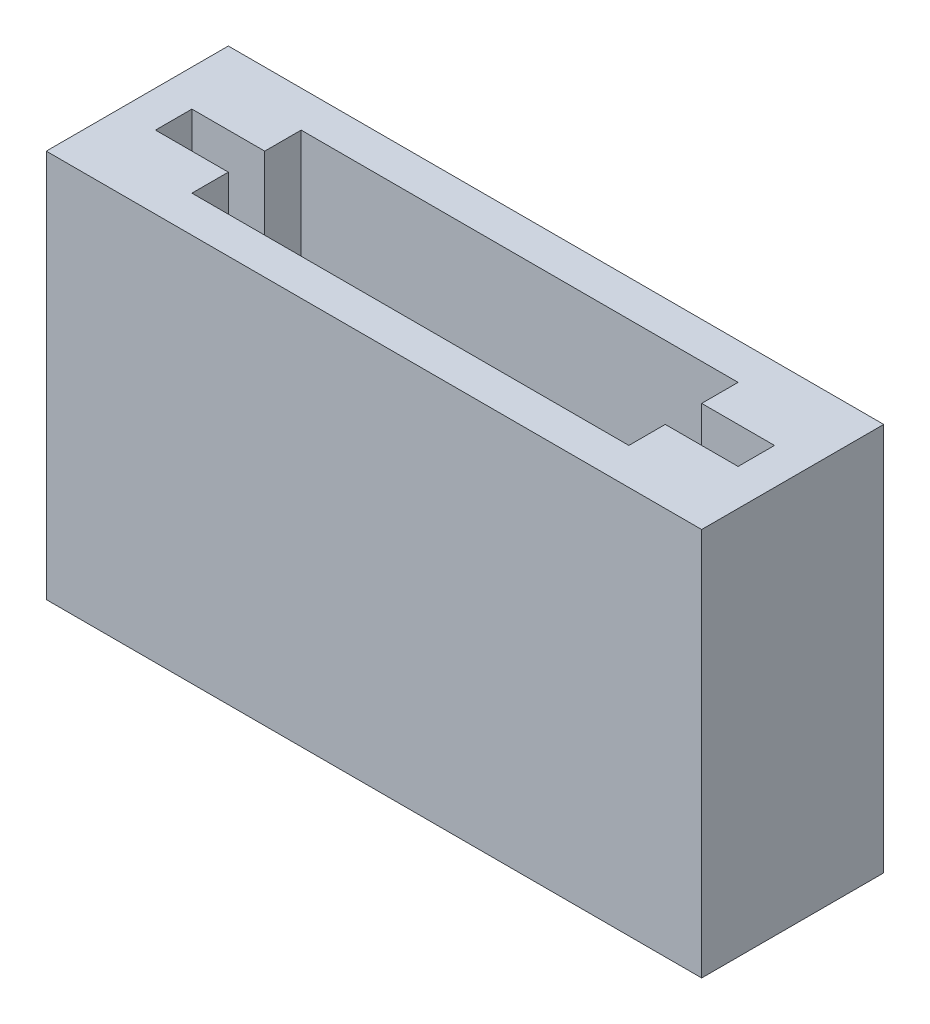
ISO-10303-21;
HEADER;
FILE_DESCRIPTION(('STEP AP214'),'2;1');
FILE_NAME('part.step','',(''),(''),'','','');
FILE_SCHEMA(('AUTOMOTIVE_DESIGN { 1 0 10303 214 1 1 1 1 }'));
ENDSEC;
DATA;
#1=APPLICATION_CONTEXT('core data for automotive mechanical design processes');
#2=APPLICATION_PROTOCOL_DEFINITION('international standard','automotive_design',2000,#1);
#3=PRODUCT_CONTEXT('',#1,'mechanical');
#4=PRODUCT('Part','Part','',(#3));
#5=PRODUCT_RELATED_PRODUCT_CATEGORY('part','',(#4));
#6=PRODUCT_DEFINITION_FORMATION('','',#4);
#7=PRODUCT_DEFINITION_CONTEXT('part definition',#1,'design');
#8=PRODUCT_DEFINITION('design','',#6,#7);
#9=PRODUCT_DEFINITION_SHAPE('','',#8);
#10=(LENGTH_UNIT() NAMED_UNIT(*) SI_UNIT(.MILLI.,.METRE.));
#11=(NAMED_UNIT(*) PLANE_ANGLE_UNIT() SI_UNIT($,.RADIAN.));
#12=(NAMED_UNIT(*) SI_UNIT($,.STERADIAN.) SOLID_ANGLE_UNIT());
#13=UNCERTAINTY_MEASURE_WITH_UNIT(LENGTH_MEASURE(1.E-05),#10,'distance_accuracy_value','');
#14=(GEOMETRIC_REPRESENTATION_CONTEXT(3) GLOBAL_UNCERTAINTY_ASSIGNED_CONTEXT((#13)) GLOBAL_UNIT_ASSIGNED_CONTEXT((#10,
#11,#12)) REPRESENTATION_CONTEXT('',''));
#15=CARTESIAN_POINT('',(0.,0.,0.));
#16=DIRECTION('',(0.,0.,1.));
#17=DIRECTION('',(1.,0.,0.));
#18=AXIS2_PLACEMENT_3D('',#15,#16,#17);
#19=CARTESIAN_POINT('',(28.575,-16.9333333333333,-7.9475));
#20=DIRECTION('',(0.,1.,0.));
#21=DIRECTION('',(-1.,0.,0.));
#22=AXIS2_PLACEMENT_3D('',#19,#20,#21);
#23=PLANE('',#22);
#24=DIRECTION('',(0.,0.,-1.));
#25=VECTOR('',#24,1.);
#26=CARTESIAN_POINT('',(28.575,-16.9333333333333,-7.9375));
#27=LINE('',#26,#25);
#28=CARTESIAN_POINT('',(28.575,-16.9333333333334,7.9375));
#29=VERTEX_POINT('',#28);
#30=CARTESIAN_POINT('',(28.575,-16.9333333333334,-7.9375));
#31=VERTEX_POINT('',#30);
#32=EDGE_CURVE('E229',#29,#31,#27,.T.);
#33=ORIENTED_EDGE('',*,*,#32,.T.);
#34=DIRECTION('',(-1.,0.,0.));
#35=VECTOR('',#34,1.);
#36=CARTESIAN_POINT('',(-28.575,-16.9333333333334,-7.9375));
#37=LINE('',#36,#35);
#38=CARTESIAN_POINT('',(-28.575,-16.9333333333334,-7.9375));
#39=VERTEX_POINT('',#38);
#40=EDGE_CURVE('E232',#31,#39,#37,.T.);
#41=ORIENTED_EDGE('',*,*,#40,.T.);
#42=DIRECTION('',(0.,0.,1.));
#43=VECTOR('',#42,1.);
#44=CARTESIAN_POINT('',(-28.575,-16.9333333333334,-7.9375));
#45=LINE('',#44,#43);
#46=CARTESIAN_POINT('',(-28.575,-16.9333333333334,7.9375));
#47=VERTEX_POINT('',#46);
#48=EDGE_CURVE('E235',#39,#47,#45,.T.);
#49=ORIENTED_EDGE('',*,*,#48,.T.);
#50=DIRECTION('',(1.,0.,0.));
#51=VECTOR('',#50,1.);
#52=CARTESIAN_POINT('',(-28.575,-16.9333333333334,7.9375));
#53=LINE('',#52,#51);
#54=EDGE_CURVE('E238',#47,#29,#53,.T.);
#55=ORIENTED_EDGE('',*,*,#54,.T.);
#56=EDGE_LOOP('',(#33,#41,#49,#55));
#57=FACE_BOUND('',#56,.T.);
#58=DIRECTION('',(-1.,0.,0.));
#59=VECTOR('',#58,1.);
#60=CARTESIAN_POINT('',(0.,-16.9333333333334,-1.5875));
#61=LINE('',#60,#59);
#62=CARTESIAN_POINT('',(-19.05,-16.9333333333334,-1.5875));
#63=VERTEX_POINT('',#62);
#64=CARTESIAN_POINT('',(-25.4,-16.9333333333334,-1.5875));
#65=VERTEX_POINT('',#64);
#66=EDGE_CURVE('E225',#63,#65,#61,.T.);
#67=ORIENTED_EDGE('',*,*,#66,.F.);
#68=DIRECTION('',(0.,0.,-1.));
#69=VECTOR('',#68,1.);
#70=CARTESIAN_POINT('',(-19.05,-16.9333333333334,0.));
#71=LINE('',#70,#69);
#72=CARTESIAN_POINT('',(-19.05,-16.9333333333334,-4.7625));
#73=VERTEX_POINT('',#72);
#74=EDGE_CURVE('E168',#63,#73,#71,.T.);
#75=ORIENTED_EDGE('',*,*,#74,.T.);
#76=DIRECTION('',(-1.,0.,0.));
#77=VECTOR('',#76,1.);
#78=CARTESIAN_POINT('',(0.,-16.9333333333334,-4.7625));
#79=LINE('',#78,#77);
#80=CARTESIAN_POINT('',(19.05,-16.9333333333333,-4.7625));
#81=VERTEX_POINT('',#80);
#82=EDGE_CURVE('E223',#81,#73,#79,.T.);
#83=ORIENTED_EDGE('',*,*,#82,.F.);
#84=DIRECTION('',(0.,0.,-1.));
#85=VECTOR('',#84,1.);
#86=CARTESIAN_POINT('',(19.05,-16.9333333333333,0.));
#87=LINE('',#86,#85);
#88=CARTESIAN_POINT('',(19.05,-16.9333333333333,-1.5875));
#89=VERTEX_POINT('',#88);
#90=EDGE_CURVE('E217',#89,#81,#87,.T.);
#91=ORIENTED_EDGE('',*,*,#90,.F.);
#92=CARTESIAN_POINT('',(25.4,-16.9333333333333,-1.5875));
#93=VERTEX_POINT('',#92);
#94=EDGE_CURVE('E226',#93,#89,#61,.T.);
#95=ORIENTED_EDGE('',*,*,#94,.F.);
#96=DIRECTION('',(0.,0.,-1.));
#97=VECTOR('',#96,1.);
#98=CARTESIAN_POINT('',(25.4,-16.9333333333333,0.));
#99=LINE('',#98,#97);
#100=CARTESIAN_POINT('',(25.4,-16.9333333333333,1.5875));
#101=VERTEX_POINT('',#100);
#102=EDGE_CURVE('E212',#101,#93,#99,.T.);
#103=ORIENTED_EDGE('',*,*,#102,.F.);
#104=DIRECTION('',(-1.,0.,0.));
#105=VECTOR('',#104,1.);
#106=CARTESIAN_POINT('',(0.,-16.9333333333334,1.5875));
#107=LINE('',#106,#105);
#108=CARTESIAN_POINT('',(19.05,-16.9333333333333,1.5875));
#109=VERTEX_POINT('',#108);
#110=EDGE_CURVE('E159',#101,#109,#107,.T.);
#111=ORIENTED_EDGE('',*,*,#110,.T.);
#112=DIRECTION('',(0.,0.,-1.));
#113=VECTOR('',#112,1.);
#114=CARTESIAN_POINT('',(19.05,-16.9333333333333,0.));
#115=LINE('',#114,#113);
#116=CARTESIAN_POINT('',(19.05,-16.9333333333334,4.7625));
#117=VERTEX_POINT('',#116);
#118=EDGE_CURVE('E208',#117,#109,#115,.T.);
#119=ORIENTED_EDGE('',*,*,#118,.F.);
#120=DIRECTION('',(-1.,0.,0.));
#121=VECTOR('',#120,1.);
#122=CARTESIAN_POINT('',(0.,-16.9333333333334,4.7625));
#123=LINE('',#122,#121);
#124=CARTESIAN_POINT('',(-19.05,-16.9333333333334,4.7625));
#125=VERTEX_POINT('',#124);
#126=EDGE_CURVE('E166',#117,#125,#123,.T.);
#127=ORIENTED_EDGE('',*,*,#126,.T.);
#128=DIRECTION('',(0.,0.,-1.));
#129=VECTOR('',#128,1.);
#130=CARTESIAN_POINT('',(-19.05,-16.9333333333334,0.));
#131=LINE('',#130,#129);
#132=CARTESIAN_POINT('',(-19.05,-16.9333333333334,1.5875));
#133=VERTEX_POINT('',#132);
#134=EDGE_CURVE('E149',#125,#133,#131,.T.);
#135=ORIENTED_EDGE('',*,*,#134,.T.);
#136=CARTESIAN_POINT('',(-25.4,-16.9333333333334,1.5875));
#137=VERTEX_POINT('',#136);
#138=EDGE_CURVE('E152',#133,#137,#107,.T.);
#139=ORIENTED_EDGE('',*,*,#138,.T.);
#140=DIRECTION('',(0.,0.,-1.));
#141=VECTOR('',#140,1.);
#142=CARTESIAN_POINT('',(-25.4,-16.9333333333334,0.));
#143=LINE('',#142,#141);
#144=EDGE_CURVE('E160',#137,#65,#143,.T.);
#145=ORIENTED_EDGE('',*,*,#144,.T.);
#146=EDGE_LOOP('',(#67,#75,#83,#91,#95,#103,#111,#119,#127,#135,#139,#145));
#147=FACE_BOUND('',#146,.T.);
#148=ADVANCED_FACE('F32',(#57,#147),#23,.T.);
#149=CARTESIAN_POINT('',(-25.4,-102.485255392617,0.));
#150=DIRECTION('',(-1.,0.,0.));
#151=DIRECTION('',(0.,0.,1.));
#152=AXIS2_PLACEMENT_3D('',#149,#150,#151);
#153=PLANE('',#152);
#154=ORIENTED_EDGE('',*,*,#144,.F.);
#155=DIRECTION('',(0.,1.,0.));
#156=VECTOR('',#155,1.);
#157=CARTESIAN_POINT('',(-25.4,-102.485255392617,1.5875));
#158=LINE('',#157,#156);
#159=CARTESIAN_POINT('',(-25.4,-47.625,1.5875));
#160=VERTEX_POINT('',#159);
#161=EDGE_CURVE('E155',#160,#137,#158,.T.);
#162=ORIENTED_EDGE('',*,*,#161,.F.);
#163=DIRECTION('',(0.,0.,-1.));
#164=VECTOR('',#163,1.);
#165=CARTESIAN_POINT('',(-25.4,-47.625,0.));
#166=LINE('',#165,#164);
#167=CARTESIAN_POINT('',(-25.4,-47.625,-1.5875));
#168=VERTEX_POINT('',#167);
#169=EDGE_CURVE('E500',#160,#168,#166,.T.);
#170=ORIENTED_EDGE('',*,*,#169,.T.);
#171=DIRECTION('',(0.,1.,0.));
#172=VECTOR('',#171,1.);
#173=CARTESIAN_POINT('',(-25.4,-102.485255392617,-1.5875));
#174=LINE('',#173,#172);
#175=EDGE_CURVE('E195',#168,#65,#174,.T.);
#176=ORIENTED_EDGE('',*,*,#175,.T.);
#177=EDGE_LOOP('',(#154,#162,#170,#176));
#178=FACE_BOUND('',#177,.T.);
#179=ADVANCED_FACE('F291',(#178),#153,.F.);
#180=CARTESIAN_POINT('',(0.,-102.485255392617,-1.5875));
#181=DIRECTION('',(0.,0.,1.));
#182=DIRECTION('',(1.,0.,0.));
#183=AXIS2_PLACEMENT_3D('',#180,#181,#182);
#184=PLANE('',#183);
#185=DIRECTION('',(0.,1.,0.));
#186=VECTOR('',#185,1.);
#187=CARTESIAN_POINT('',(-19.05,-102.485255392617,-1.5875));
#188=LINE('',#187,#186);
#189=CARTESIAN_POINT('',(-19.05,-47.625,-1.5875));
#190=VERTEX_POINT('',#189);
#191=EDGE_CURVE('E193',#190,#63,#188,.T.);
#192=ORIENTED_EDGE('',*,*,#191,.T.);
#193=ORIENTED_EDGE('',*,*,#66,.T.);
#194=ORIENTED_EDGE('',*,*,#175,.F.);
#195=DIRECTION('',(-1.,0.,0.));
#196=VECTOR('',#195,1.);
#197=CARTESIAN_POINT('',(0.,-47.625,-1.5875));
#198=LINE('',#197,#196);
#199=EDGE_CURVE('E502',#190,#168,#198,.T.);
#200=ORIENTED_EDGE('',*,*,#199,.F.);
#201=EDGE_LOOP('',(#192,#193,#194,#200));
#202=FACE_BOUND('',#201,.T.);
#203=ADVANCED_FACE('F293',(#202),#184,.T.);
#204=CARTESIAN_POINT('',(-19.05,-102.485255392617,0.));
#205=DIRECTION('',(-1.,0.,0.));
#206=DIRECTION('',(0.,0.,1.));
#207=AXIS2_PLACEMENT_3D('',#204,#205,#206);
#208=PLANE('',#207);
#209=ORIENTED_EDGE('',*,*,#74,.F.);
#210=ORIENTED_EDGE('',*,*,#191,.F.);
#211=DIRECTION('',(0.,0.,-1.));
#212=VECTOR('',#211,1.);
#213=CARTESIAN_POINT('',(-19.05,-47.625,0.));
#214=LINE('',#213,#212);
#215=CARTESIAN_POINT('',(-19.05,-47.625,-4.7625));
#216=VERTEX_POINT('',#215);
#217=EDGE_CURVE('E249',#190,#216,#214,.T.);
#218=ORIENTED_EDGE('',*,*,#217,.T.);
#219=DIRECTION('',(0.,1.,0.));
#220=VECTOR('',#219,1.);
#221=CARTESIAN_POINT('',(-19.05,-102.485255392617,-4.7625));
#222=LINE('',#221,#220);
#223=EDGE_CURVE('E190',#216,#73,#222,.T.);
#224=ORIENTED_EDGE('',*,*,#223,.T.);
#225=EDGE_LOOP('',(#209,#210,#218,#224));
#226=FACE_BOUND('',#225,.T.);
#227=ADVANCED_FACE('F247',(#226),#208,.F.);
#228=CARTESIAN_POINT('',(0.,-102.485255392617,-4.7625));
#229=DIRECTION('',(0.,0.,1.));
#230=DIRECTION('',(1.,0.,0.));
#231=AXIS2_PLACEMENT_3D('',#228,#229,#230);
#232=PLANE('',#231);
#233=DIRECTION('',(0.,1.,0.));
#234=VECTOR('',#233,1.);
#235=CARTESIAN_POINT('',(19.05,-102.485255392617,-4.7625));
#236=LINE('',#235,#234);
#237=CARTESIAN_POINT('',(19.05,-47.625,-4.7625));
#238=VERTEX_POINT('',#237);
#239=EDGE_CURVE('E187',#238,#81,#236,.T.);
#240=ORIENTED_EDGE('',*,*,#239,.T.);
#241=ORIENTED_EDGE('',*,*,#82,.T.);
#242=ORIENTED_EDGE('',*,*,#223,.F.);
#243=DIRECTION('',(-1.,0.,0.));
#244=VECTOR('',#243,1.);
#245=CARTESIAN_POINT('',(0.,-47.625,-4.7625));
#246=LINE('',#245,#244);
#247=EDGE_CURVE('E253',#238,#216,#246,.T.);
#248=ORIENTED_EDGE('',*,*,#247,.F.);
#249=EDGE_LOOP('',(#240,#241,#242,#248));
#250=FACE_BOUND('',#249,.T.);
#251=ADVANCED_FACE('F252',(#250),#232,.T.);
#252=DIRECTION('',(0.,1.,0.));
#253=VECTOR('',#252,1.);
#254=CARTESIAN_POINT('',(25.4,-102.485255392617,-1.5875));
#255=LINE('',#254,#253);
#256=CARTESIAN_POINT('',(25.4,-47.625,-1.5875));
#257=VERTEX_POINT('',#256);
#258=EDGE_CURVE('E181',#257,#93,#255,.T.);
#259=ORIENTED_EDGE('',*,*,#258,.T.);
#260=ORIENTED_EDGE('',*,*,#94,.T.);
#261=DIRECTION('',(0.,1.,0.));
#262=VECTOR('',#261,1.);
#263=CARTESIAN_POINT('',(19.05,-102.485255392617,-1.5875));
#264=LINE('',#263,#262);
#265=CARTESIAN_POINT('',(19.05,-47.625,-1.5875));
#266=VERTEX_POINT('',#265);
#267=EDGE_CURVE('E184',#266,#89,#264,.T.);
#268=ORIENTED_EDGE('',*,*,#267,.F.);
#269=DIRECTION('',(-1.,0.,0.));
#270=VECTOR('',#269,1.);
#271=CARTESIAN_POINT('',(0.,-47.625,-1.5875));
#272=LINE('',#271,#270);
#273=EDGE_CURVE('E265',#257,#266,#272,.T.);
#274=ORIENTED_EDGE('',*,*,#273,.F.);
#275=EDGE_LOOP('',(#259,#260,#268,#274));
#276=FACE_BOUND('',#275,.T.);
#277=ADVANCED_FACE('F263',(#276),#184,.T.);
#278=CARTESIAN_POINT('',(0.,-102.485255392617,1.5875));
#279=DIRECTION('',(0.,0.,1.));
#280=DIRECTION('',(1.,0.,0.));
#281=AXIS2_PLACEMENT_3D('',#278,#279,#280);
#282=PLANE('',#281);
#283=ORIENTED_EDGE('',*,*,#110,.F.);
#284=DIRECTION('',(0.,1.,0.));
#285=VECTOR('',#284,1.);
#286=CARTESIAN_POINT('',(25.4,-102.485255392617,1.5875));
#287=LINE('',#286,#285);
#288=CARTESIAN_POINT('',(25.4,-47.625,1.5875));
#289=VERTEX_POINT('',#288);
#290=EDGE_CURVE('E178',#289,#101,#287,.T.);
#291=ORIENTED_EDGE('',*,*,#290,.F.);
#292=DIRECTION('',(-1.,0.,0.));
#293=VECTOR('',#292,1.);
#294=CARTESIAN_POINT('',(0.,-47.625,1.5875));
#295=LINE('',#294,#293);
#296=CARTESIAN_POINT('',(19.05,-47.625,1.5875));
#297=VERTEX_POINT('',#296);
#298=EDGE_CURVE('E275',#289,#297,#295,.T.);
#299=ORIENTED_EDGE('',*,*,#298,.T.);
#300=DIRECTION('',(0.,1.,0.));
#301=VECTOR('',#300,1.);
#302=CARTESIAN_POINT('',(19.05,-102.485255392617,1.5875));
#303=LINE('',#302,#301);
#304=EDGE_CURVE('E175',#297,#109,#303,.T.);
#305=ORIENTED_EDGE('',*,*,#304,.T.);
#306=EDGE_LOOP('',(#283,#291,#299,#305));
#307=FACE_BOUND('',#306,.T.);
#308=ADVANCED_FACE('F274',(#307),#282,.F.);
#309=CARTESIAN_POINT('',(19.05,-102.485255392617,0.));
#310=DIRECTION('',(-1.,0.,0.));
#311=DIRECTION('',(0.,0.,1.));
#312=AXIS2_PLACEMENT_3D('',#309,#310,#311);
#313=PLANE('',#312);
#314=DIRECTION('',(0.,1.,0.));
#315=VECTOR('',#314,1.);
#316=CARTESIAN_POINT('',(19.05,-102.485255392617,4.7625));
#317=LINE('',#316,#315);
#318=CARTESIAN_POINT('',(19.05,-47.625,4.7625));
#319=VERTEX_POINT('',#318);
#320=EDGE_CURVE('E173',#319,#117,#317,.T.);
#321=ORIENTED_EDGE('',*,*,#320,.T.);
#322=ORIENTED_EDGE('',*,*,#118,.T.);
#323=ORIENTED_EDGE('',*,*,#304,.F.);
#324=DIRECTION('',(0.,0.,-1.));
#325=VECTOR('',#324,1.);
#326=CARTESIAN_POINT('',(19.05,-47.625,0.));
#327=LINE('',#326,#325);
#328=EDGE_CURVE('E278',#319,#297,#327,.T.);
#329=ORIENTED_EDGE('',*,*,#328,.F.);
#330=EDGE_LOOP('',(#321,#322,#323,#329));
#331=FACE_BOUND('',#330,.T.);
#332=ADVANCED_FACE('F277',(#331),#313,.T.);
#333=ORIENTED_EDGE('',*,*,#138,.F.);
#334=DIRECTION('',(0.,1.,0.));
#335=VECTOR('',#334,1.);
#336=CARTESIAN_POINT('',(-19.05,-102.485255392617,1.5875));
#337=LINE('',#336,#335);
#338=CARTESIAN_POINT('',(-19.05,-47.625,1.5875));
#339=VERTEX_POINT('',#338);
#340=EDGE_CURVE('E11',#339,#133,#337,.T.);
#341=ORIENTED_EDGE('',*,*,#340,.F.);
#342=DIRECTION('',(-1.,0.,0.));
#343=VECTOR('',#342,1.);
#344=CARTESIAN_POINT('',(0.,-47.625,1.5875));
#345=LINE('',#344,#343);
#346=EDGE_CURVE('E494',#339,#160,#345,.T.);
#347=ORIENTED_EDGE('',*,*,#346,.T.);
#348=ORIENTED_EDGE('',*,*,#161,.T.);
#349=EDGE_LOOP('',(#333,#341,#347,#348));
#350=FACE_BOUND('',#349,.T.);
#351=ADVANCED_FACE('F153',(#350),#282,.F.);
#352=CARTESIAN_POINT('',(0.,-47.625,0.));
#353=DIRECTION('',(0.,1.,0.));
#354=DIRECTION('',(0.,0.,1.));
#355=AXIS2_PLACEMENT_3D('',#352,#353,#354);
#356=PLANE('',#355);
#357=ORIENTED_EDGE('',*,*,#346,.F.);
#358=DIRECTION('',(0.,0.,-1.));
#359=VECTOR('',#358,1.);
#360=CARTESIAN_POINT('',(-19.05,-47.625,0.));
#361=LINE('',#360,#359);
#362=CARTESIAN_POINT('',(-19.05,-47.625,4.7625));
#363=VERTEX_POINT('',#362);
#364=EDGE_CURVE('E55',#363,#339,#361,.T.);
#365=ORIENTED_EDGE('',*,*,#364,.F.);
#366=DIRECTION('',(-1.,0.,0.));
#367=VECTOR('',#366,1.);
#368=CARTESIAN_POINT('',(0.,-47.625,4.7625));
#369=LINE('',#368,#367);
#370=EDGE_CURVE('E49',#319,#363,#369,.T.);
#371=ORIENTED_EDGE('',*,*,#370,.F.);
#372=ORIENTED_EDGE('',*,*,#328,.T.);
#373=ORIENTED_EDGE('',*,*,#298,.F.);
#374=DIRECTION('',(0.,0.,-1.));
#375=VECTOR('',#374,1.);
#376=CARTESIAN_POINT('',(25.4,-47.625,0.));
#377=LINE('',#376,#375);
#378=EDGE_CURVE('E269',#289,#257,#377,.T.);
#379=ORIENTED_EDGE('',*,*,#378,.T.);
#380=ORIENTED_EDGE('',*,*,#273,.T.);
#381=DIRECTION('',(0.,0.,-1.));
#382=VECTOR('',#381,1.);
#383=CARTESIAN_POINT('',(19.05,-47.625,0.));
#384=LINE('',#383,#382);
#385=EDGE_CURVE('E258',#266,#238,#384,.T.);
#386=ORIENTED_EDGE('',*,*,#385,.T.);
#387=ORIENTED_EDGE('',*,*,#247,.T.);
#388=ORIENTED_EDGE('',*,*,#217,.F.);
#389=ORIENTED_EDGE('',*,*,#199,.T.);
#390=ORIENTED_EDGE('',*,*,#169,.F.);
#391=EDGE_LOOP('',(#357,#365,#371,#372,#373,#379,#380,#386,#387,#388,#389,#390));
#392=FACE_BOUND('',#391,.T.);
#393=ADVANCED_FACE('F280',(#392),#356,.T.);
#394=CARTESIAN_POINT('',(0.,-102.485255392617,4.7625));
#395=DIRECTION('',(0.,0.,1.));
#396=DIRECTION('',(1.,0.,0.));
#397=AXIS2_PLACEMENT_3D('',#394,#395,#396);
#398=PLANE('',#397);
#399=ORIENTED_EDGE('',*,*,#126,.F.);
#400=ORIENTED_EDGE('',*,*,#320,.F.);
#401=ORIENTED_EDGE('',*,*,#370,.T.);
#402=DIRECTION('',(0.,1.,0.));
#403=VECTOR('',#402,1.);
#404=CARTESIAN_POINT('',(-19.05,-102.485255392617,4.7625));
#405=LINE('',#404,#403);
#406=EDGE_CURVE('E41',#363,#125,#405,.T.);
#407=ORIENTED_EDGE('',*,*,#406,.T.);
#408=EDGE_LOOP('',(#399,#400,#401,#407));
#409=FACE_BOUND('',#408,.T.);
#410=ADVANCED_FACE('F281',(#409),#398,.F.);
#411=CARTESIAN_POINT('',(-19.05,-102.485255392617,0.));
#412=DIRECTION('',(-1.,0.,0.));
#413=DIRECTION('',(0.,0.,1.));
#414=AXIS2_PLACEMENT_3D('',#411,#412,#413);
#415=PLANE('',#414);
#416=ORIENTED_EDGE('',*,*,#134,.F.);
#417=ORIENTED_EDGE('',*,*,#406,.F.);
#418=ORIENTED_EDGE('',*,*,#364,.T.);
#419=ORIENTED_EDGE('',*,*,#340,.T.);
#420=EDGE_LOOP('',(#416,#417,#418,#419));
#421=FACE_BOUND('',#420,.T.);
#422=ADVANCED_FACE('F147',(#421),#415,.F.);
#423=CARTESIAN_POINT('',(25.4,-102.485255392617,0.));
#424=DIRECTION('',(-1.,0.,0.));
#425=DIRECTION('',(0.,0.,1.));
#426=AXIS2_PLACEMENT_3D('',#423,#424,#425);
#427=PLANE('',#426);
#428=ORIENTED_EDGE('',*,*,#290,.T.);
#429=ORIENTED_EDGE('',*,*,#102,.T.);
#430=ORIENTED_EDGE('',*,*,#258,.F.);
#431=ORIENTED_EDGE('',*,*,#378,.F.);
#432=EDGE_LOOP('',(#428,#429,#430,#431));
#433=FACE_BOUND('',#432,.T.);
#434=ADVANCED_FACE('F268',(#433),#427,.T.);
#435=CARTESIAN_POINT('',(19.05,-102.485255392617,0.));
#436=DIRECTION('',(-1.,0.,0.));
#437=DIRECTION('',(0.,0.,1.));
#438=AXIS2_PLACEMENT_3D('',#435,#436,#437);
#439=PLANE('',#438);
#440=ORIENTED_EDGE('',*,*,#267,.T.);
#441=ORIENTED_EDGE('',*,*,#90,.T.);
#442=ORIENTED_EDGE('',*,*,#239,.F.);
#443=ORIENTED_EDGE('',*,*,#385,.F.);
#444=EDGE_LOOP('',(#440,#441,#442,#443));
#445=FACE_BOUND('',#444,.T.);
#446=ADVANCED_FACE('F257',(#445),#439,.T.);
#447=CARTESIAN_POINT('',(-28.575,50.8,-7.9375));
#448=DIRECTION('',(0.,0.,1.));
#449=DIRECTION('',(1.,0.,0.));
#450=AXIS2_PLACEMENT_3D('',#447,#448,#449);
#451=PLANE('',#450);
#452=ORIENTED_EDGE('',*,*,#40,.F.);
#453=DIRECTION('',(0.,-1.,0.));
#454=VECTOR('',#453,1.);
#455=CARTESIAN_POINT('',(28.575,50.8,-7.9375));
#456=LINE('',#455,#454);
#457=CARTESIAN_POINT('',(28.575,-50.8,-7.9375));
#458=VERTEX_POINT('',#457);
#459=EDGE_CURVE('E36',#31,#458,#456,.T.);
#460=ORIENTED_EDGE('',*,*,#459,.T.);
#461=DIRECTION('',(-1.,0.,0.));
#462=VECTOR('',#461,1.);
#463=CARTESIAN_POINT('',(-28.575,-50.8,-7.9375));
#464=LINE('',#463,#462);
#465=CARTESIAN_POINT('',(-28.575,-50.8,-7.9375));
#466=VERTEX_POINT('',#465);
#467=EDGE_CURVE('E492',#458,#466,#464,.T.);
#468=ORIENTED_EDGE('',*,*,#467,.T.);
#469=DIRECTION('',(0.,-1.,0.));
#470=VECTOR('',#469,1.);
#471=CARTESIAN_POINT('',(-28.575,50.8,-7.9375));
#472=LINE('',#471,#470);
#473=EDGE_CURVE('E203',#39,#466,#472,.T.);
#474=ORIENTED_EDGE('',*,*,#473,.F.);
#475=EDGE_LOOP('',(#452,#460,#468,#474));
#476=FACE_BOUND('',#475,.T.);
#477=ADVANCED_FACE('F312',(#476),#451,.F.);
#478=CARTESIAN_POINT('',(28.575,50.8,-7.9375));
#479=DIRECTION('',(-1.,0.,0.));
#480=DIRECTION('',(0.,0.,1.));
#481=AXIS2_PLACEMENT_3D('',#478,#479,#480);
#482=PLANE('',#481);
#483=ORIENTED_EDGE('',*,*,#32,.F.);
#484=DIRECTION('',(0.,-1.,0.));
#485=VECTOR('',#484,1.);
#486=CARTESIAN_POINT('',(28.575,50.8,7.9375));
#487=LINE('',#486,#485);
#488=CARTESIAN_POINT('',(28.575,-50.8,7.9375));
#489=VERTEX_POINT('',#488);
#490=EDGE_CURVE('E199',#29,#489,#487,.T.);
#491=ORIENTED_EDGE('',*,*,#490,.T.);
#492=DIRECTION('',(0.,0.,-1.));
#493=VECTOR('',#492,1.);
#494=CARTESIAN_POINT('',(28.575,-50.8,-7.9375));
#495=LINE('',#494,#493);
#496=EDGE_CURVE('E491',#489,#458,#495,.T.);
#497=ORIENTED_EDGE('',*,*,#496,.T.);
#498=ORIENTED_EDGE('',*,*,#459,.F.);
#499=EDGE_LOOP('',(#483,#491,#497,#498));
#500=FACE_BOUND('',#499,.T.);
#501=ADVANCED_FACE('F399',(#500),#482,.F.);
#502=CARTESIAN_POINT('',(0.,-50.8,0.));
#503=DIRECTION('',(0.,1.,0.));
#504=DIRECTION('',(0.,0.,1.));
#505=AXIS2_PLACEMENT_3D('',#502,#503,#504);
#506=PLANE('',#505);
#507=ORIENTED_EDGE('',*,*,#496,.F.);
#508=DIRECTION('',(1.,0.,0.));
#509=VECTOR('',#508,1.);
#510=CARTESIAN_POINT('',(-28.575,-50.8,7.9375));
#511=LINE('',#510,#509);
#512=CARTESIAN_POINT('',(-28.575,-50.8,7.9375));
#513=VERTEX_POINT('',#512);
#514=EDGE_CURVE('E201',#513,#489,#511,.T.);
#515=ORIENTED_EDGE('',*,*,#514,.F.);
#516=DIRECTION('',(0.,0.,1.));
#517=VECTOR('',#516,1.);
#518=CARTESIAN_POINT('',(-28.575,-50.8,-7.9375));
#519=LINE('',#518,#517);
#520=EDGE_CURVE('E489',#466,#513,#519,.T.);
#521=ORIENTED_EDGE('',*,*,#520,.F.);
#522=ORIENTED_EDGE('',*,*,#467,.F.);
#523=EDGE_LOOP('',(#507,#515,#521,#522));
#524=FACE_BOUND('',#523,.T.);
#525=ADVANCED_FACE('F393',(#524),#506,.F.);
#526=CARTESIAN_POINT('',(-28.575,50.8,-7.9375));
#527=DIRECTION('',(1.,0.,0.));
#528=DIRECTION('',(0.,0.,-1.));
#529=AXIS2_PLACEMENT_3D('',#526,#527,#528);
#530=PLANE('',#529);
#531=ORIENTED_EDGE('',*,*,#48,.F.);
#532=ORIENTED_EDGE('',*,*,#473,.T.);
#533=ORIENTED_EDGE('',*,*,#520,.T.);
#534=DIRECTION('',(0.,-1.,0.));
#535=VECTOR('',#534,1.);
#536=CARTESIAN_POINT('',(-28.575,50.8,7.9375));
#537=LINE('',#536,#535);
#538=EDGE_CURVE('E202',#47,#513,#537,.T.);
#539=ORIENTED_EDGE('',*,*,#538,.F.);
#540=EDGE_LOOP('',(#531,#532,#533,#539));
#541=FACE_BOUND('',#540,.T.);
#542=ADVANCED_FACE('F398',(#541),#530,.F.);
#543=CARTESIAN_POINT('',(-28.575,50.8,7.9375));
#544=DIRECTION('',(0.,0.,-1.));
#545=DIRECTION('',(-1.,0.,0.));
#546=AXIS2_PLACEMENT_3D('',#543,#544,#545);
#547=PLANE('',#546);
#548=ORIENTED_EDGE('',*,*,#54,.F.);
#549=ORIENTED_EDGE('',*,*,#538,.T.);
#550=ORIENTED_EDGE('',*,*,#514,.T.);
#551=ORIENTED_EDGE('',*,*,#490,.F.);
#552=EDGE_LOOP('',(#548,#549,#550,#551));
#553=FACE_BOUND('',#552,.T.);
#554=ADVANCED_FACE('F34',(#553),#547,.F.);
#555=CLOSED_SHELL('',(#148,#179,#203,#227,#251,#277,#308,#332,#351,#393,#410,#422,#434,#446,
#477,#501,#525,#542,#554));
#556=MANIFOLD_SOLID_BREP('B2',#555);
#557=ADVANCED_BREP_SHAPE_REPRESENTATION('',(#18,#556),#14);
#558=SHAPE_DEFINITION_REPRESENTATION(#9,#557);
ENDSEC;
END-ISO-10303-21;
